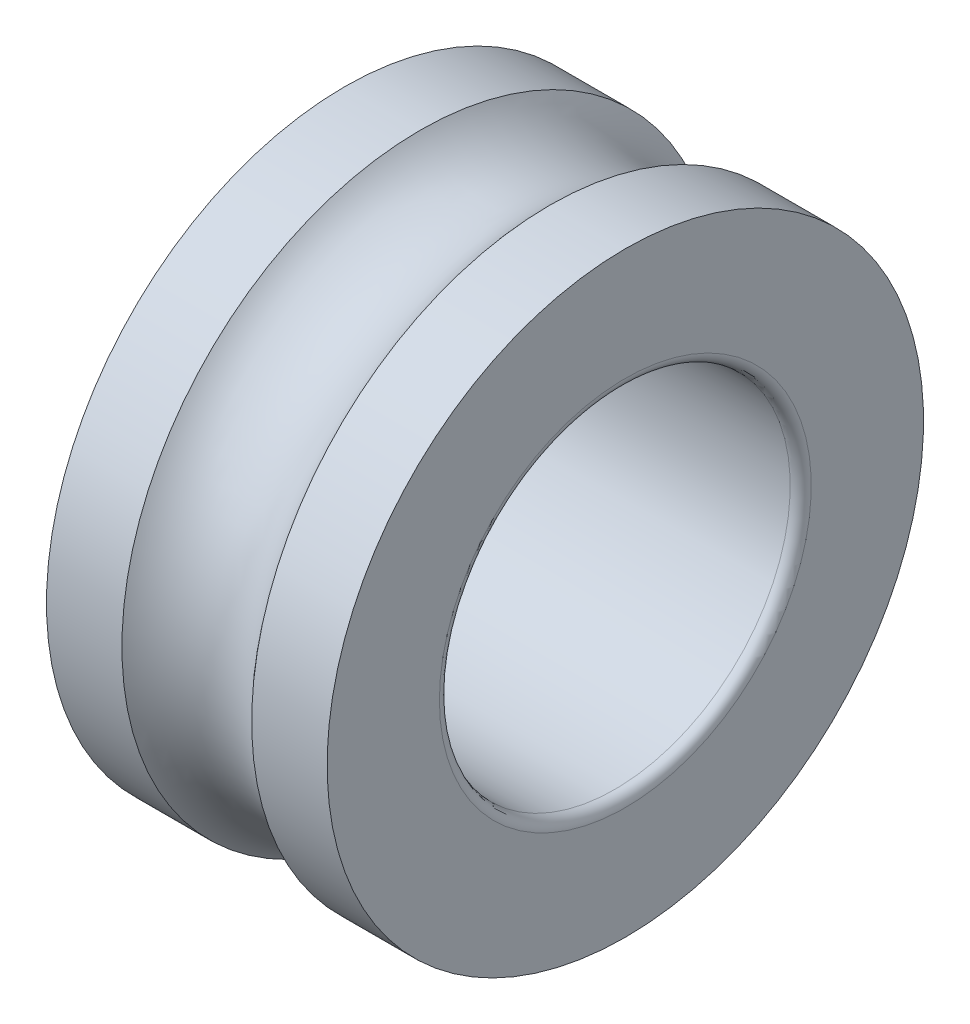
ISO-10303-21;
HEADER;
FILE_DESCRIPTION(('STEP AP214'),'2;1');
FILE_NAME('part.step','',(''),(''),'','','');
FILE_SCHEMA(('AUTOMOTIVE_DESIGN { 1 0 10303 214 1 1 1 1 }'));
ENDSEC;
DATA;
#1=APPLICATION_CONTEXT('core data for automotive mechanical design processes');
#2=APPLICATION_PROTOCOL_DEFINITION('international standard','automotive_design',2000,#1);
#3=PRODUCT_CONTEXT('',#1,'mechanical');
#4=PRODUCT('Part','Part','',(#3));
#5=PRODUCT_RELATED_PRODUCT_CATEGORY('part','',(#4));
#6=PRODUCT_DEFINITION_FORMATION('','',#4);
#7=PRODUCT_DEFINITION_CONTEXT('part definition',#1,'design');
#8=PRODUCT_DEFINITION('design','',#6,#7);
#9=PRODUCT_DEFINITION_SHAPE('','',#8);
#10=(LENGTH_UNIT() NAMED_UNIT(*) SI_UNIT(.MILLI.,.METRE.));
#11=(NAMED_UNIT(*) PLANE_ANGLE_UNIT() SI_UNIT($,.RADIAN.));
#12=(NAMED_UNIT(*) SI_UNIT($,.STERADIAN.) SOLID_ANGLE_UNIT());
#13=UNCERTAINTY_MEASURE_WITH_UNIT(LENGTH_MEASURE(1.E-05),#10,'distance_accuracy_value','');
#14=(GEOMETRIC_REPRESENTATION_CONTEXT(3) GLOBAL_UNCERTAINTY_ASSIGNED_CONTEXT((#13)) GLOBAL_UNIT_ASSIGNED_CONTEXT((#10,
#11,#12)) REPRESENTATION_CONTEXT('',''));
#15=CARTESIAN_POINT('',(0.,0.,0.));
#16=DIRECTION('',(0.,0.,1.));
#17=DIRECTION('',(1.,0.,0.));
#18=AXIS2_PLACEMENT_3D('',#15,#16,#17);
#19=CARTESIAN_POINT('',(0.,6.9,0.));
#20=DIRECTION('',(-1.,0.,0.));
#21=DIRECTION('',(0.,0.,1.));
#22=AXIS2_PLACEMENT_3D('',#19,#20,#21);
#23=PLANE('',#22);
#24=CARTESIAN_POINT('',(0.,0.,0.));
#25=DIRECTION('',(1.,0.,0.));
#26=DIRECTION('',(0.,1.,0.));
#27=AXIS2_PLACEMENT_3D('',#24,#25,#26);
#28=CIRCLE('',#27,5.3);
#29=CARTESIAN_POINT('',(0.,0.,5.3));
#30=VERTEX_POINT('',#29);
#31=EDGE_CURVE('E84',#30,#30,#28,.T.);
#32=ORIENTED_EDGE('',*,*,#31,.T.);
#33=EDGE_LOOP('',(#32));
#34=FACE_BOUND('',#33,.T.);
#35=CARTESIAN_POINT('',(0.,0.,0.));
#36=DIRECTION('',(1.,0.,0.));
#37=DIRECTION('',(0.,1.,0.));
#38=AXIS2_PLACEMENT_3D('',#35,#36,#37);
#39=CIRCLE('',#38,8.5);
#40=CARTESIAN_POINT('',(0.,-8.5,0.));
#41=VERTEX_POINT('',#40);
#42=EDGE_CURVE('E52',#41,#41,#39,.T.);
#43=ORIENTED_EDGE('',*,*,#42,.F.);
#44=EDGE_LOOP('',(#43));
#45=FACE_BOUND('',#44,.T.);
#46=ADVANCED_FACE('F16',(#34,#45),#23,.T.);
#47=CARTESIAN_POINT('',(8.,6.9,0.));
#48=DIRECTION('',(1.,0.,0.));
#49=DIRECTION('',(0.,1.,0.));
#50=AXIS2_PLACEMENT_3D('',#47,#48,#49);
#51=PLANE('',#50);
#52=CARTESIAN_POINT('',(8.,0.,0.));
#53=DIRECTION('',(1.,0.,0.));
#54=DIRECTION('',(0.,1.,0.));
#55=AXIS2_PLACEMENT_3D('',#52,#53,#54);
#56=CIRCLE('',#55,5.3);
#57=CARTESIAN_POINT('',(8.,0.,5.3));
#58=VERTEX_POINT('',#57);
#59=EDGE_CURVE('E11',#58,#58,#56,.T.);
#60=ORIENTED_EDGE('',*,*,#59,.F.);
#61=EDGE_LOOP('',(#60));
#62=FACE_BOUND('',#61,.T.);
#63=CARTESIAN_POINT('',(8.,0.,0.));
#64=DIRECTION('',(1.,0.,0.));
#65=DIRECTION('',(0.,1.,0.));
#66=AXIS2_PLACEMENT_3D('',#63,#64,#65);
#67=CIRCLE('',#66,8.5);
#68=CARTESIAN_POINT('',(8.,-8.5,0.));
#69=VERTEX_POINT('',#68);
#70=EDGE_CURVE('E57',#69,#69,#67,.T.);
#71=ORIENTED_EDGE('',*,*,#70,.T.);
#72=EDGE_LOOP('',(#71));
#73=FACE_BOUND('',#72,.T.);
#74=ADVANCED_FACE('F18',(#62,#73),#51,.T.);
#75=CARTESIAN_POINT('',(7.7,0.,0.));
#76=DIRECTION('',(1.,0.,0.));
#77=DIRECTION('',(0.,0.,-1.));
#78=AXIS2_PLACEMENT_3D('',#75,#76,#77);
#79=TOROIDAL_SURFACE('',#78,5.3,0.3);
#80=ORIENTED_EDGE('',*,*,#59,.T.);
#81=EDGE_LOOP('',(#80));
#82=FACE_BOUND('',#81,.T.);
#83=CARTESIAN_POINT('',(7.7,0.,0.));
#84=DIRECTION('',(1.,0.,0.));
#85=DIRECTION('',(0.,1.,0.));
#86=AXIS2_PLACEMENT_3D('',#83,#84,#85);
#87=CIRCLE('',#86,5.);
#88=CARTESIAN_POINT('',(7.7,0.,5.));
#89=VERTEX_POINT('',#88);
#90=EDGE_CURVE('E26',#89,#89,#87,.T.);
#91=ORIENTED_EDGE('',*,*,#90,.F.);
#92=EDGE_LOOP('',(#91));
#93=FACE_BOUND('',#92,.T.);
#94=ADVANCED_FACE('F120',(#82,#93),#79,.T.);
#95=CARTESIAN_POINT('',(4.,0.,0.));
#96=DIRECTION('',(1.,0.,0.));
#97=DIRECTION('',(0.,1.,0.));
#98=AXIS2_PLACEMENT_3D('',#95,#96,#97);
#99=CYLINDRICAL_SURFACE('',#98,5.);
#100=CARTESIAN_POINT('',(0.3,0.,0.));
#101=DIRECTION('',(1.,0.,0.));
#102=DIRECTION('',(0.,1.,0.));
#103=AXIS2_PLACEMENT_3D('',#100,#101,#102);
#104=CIRCLE('',#103,5.);
#105=CARTESIAN_POINT('',(0.3,-5.,0.));
#106=VERTEX_POINT('',#105);
#107=EDGE_CURVE('E79',#106,#106,#104,.T.);
#108=ORIENTED_EDGE('',*,*,#107,.F.);
#109=EDGE_LOOP('',(#108));
#110=FACE_BOUND('',#109,.T.);
#111=ORIENTED_EDGE('',*,*,#90,.T.);
#112=EDGE_LOOP('',(#111));
#113=FACE_BOUND('',#112,.T.);
#114=ADVANCED_FACE('F111',(#110,#113),#99,.F.);
#115=CARTESIAN_POINT('',(0.3,0.,0.));
#116=DIRECTION('',(1.,0.,0.));
#117=DIRECTION('',(0.,0.,-1.));
#118=AXIS2_PLACEMENT_3D('',#115,#116,#117);
#119=TOROIDAL_SURFACE('',#118,5.3,0.3);
#120=ORIENTED_EDGE('',*,*,#107,.T.);
#121=EDGE_LOOP('',(#120));
#122=FACE_BOUND('',#121,.T.);
#123=ORIENTED_EDGE('',*,*,#31,.F.);
#124=EDGE_LOOP('',(#123));
#125=FACE_BOUND('',#124,.T.);
#126=ADVANCED_FACE('F80',(#122,#125),#119,.T.);
#127=CARTESIAN_POINT('',(1.07545132632186,0.,0.));
#128=DIRECTION('',(1.,0.,0.));
#129=DIRECTION('',(0.,1.,0.));
#130=AXIS2_PLACEMENT_3D('',#127,#128,#129);
#131=CYLINDRICAL_SURFACE('',#130,8.5);
#132=ORIENTED_EDGE('',*,*,#42,.T.);
#133=EDGE_LOOP('',(#132));
#134=FACE_BOUND('',#133,.T.);
#135=CARTESIAN_POINT('',(2.15090265264373,0.,0.));
#136=DIRECTION('',(1.,0.,0.));
#137=DIRECTION('',(0.,1.,0.));
#138=AXIS2_PLACEMENT_3D('',#135,#136,#137);
#139=CIRCLE('',#138,8.5);
#140=CARTESIAN_POINT('',(2.15090265264373,8.5,0.));
#141=VERTEX_POINT('',#140);
#142=EDGE_CURVE('E73',#141,#141,#139,.T.);
#143=ORIENTED_EDGE('',*,*,#142,.F.);
#144=EDGE_LOOP('',(#143));
#145=FACE_BOUND('',#144,.T.);
#146=ADVANCED_FACE('F110',(#134,#145),#131,.T.);
#147=CARTESIAN_POINT('',(6.92454867367814,0.,0.));
#148=DIRECTION('',(1.,0.,0.));
#149=DIRECTION('',(0.,1.,0.));
#150=AXIS2_PLACEMENT_3D('',#147,#148,#149);
#151=CYLINDRICAL_SURFACE('',#150,8.5);
#152=CARTESIAN_POINT('',(5.84909734735627,0.,0.));
#153=DIRECTION('',(1.,0.,0.));
#154=DIRECTION('',(0.,1.,0.));
#155=AXIS2_PLACEMENT_3D('',#152,#153,#154);
#156=CIRCLE('',#155,8.5);
#157=CARTESIAN_POINT('',(5.84909734735627,-8.5,0.));
#158=VERTEX_POINT('',#157);
#159=EDGE_CURVE('E64',#158,#158,#156,.T.);
#160=ORIENTED_EDGE('',*,*,#159,.T.);
#161=EDGE_LOOP('',(#160));
#162=FACE_BOUND('',#161,.T.);
#163=ORIENTED_EDGE('',*,*,#70,.F.);
#164=EDGE_LOOP('',(#163));
#165=FACE_BOUND('',#164,.T.);
#166=ADVANCED_FACE('F118',(#162,#165),#151,.T.);
#167=CARTESIAN_POINT('',(4.,0.,0.));
#168=DIRECTION('',(1.,0.,0.));
#169=DIRECTION('',(0.,0.,-1.));
#170=AXIS2_PLACEMENT_3D('',#167,#168,#169);
#171=TOROIDAL_SURFACE('',#170,10.,2.381);
#172=ORIENTED_EDGE('',*,*,#159,.F.);
#173=EDGE_LOOP('',(#172));
#174=FACE_BOUND('',#173,.T.);
#175=ORIENTED_EDGE('',*,*,#142,.T.);
#176=EDGE_LOOP('',(#175));
#177=FACE_BOUND('',#176,.T.);
#178=ADVANCED_FACE('F130',(#174,#177),#171,.F.);
#179=CLOSED_SHELL('',(#46,#74,#94,#114,#126,#146,#166,#178));
#180=MANIFOLD_SOLID_BREP('B1',#179);
#181=ADVANCED_BREP_SHAPE_REPRESENTATION('',(#18,#180),#14);
#182=SHAPE_DEFINITION_REPRESENTATION(#9,#181);
ENDSEC;
END-ISO-10303-21;
